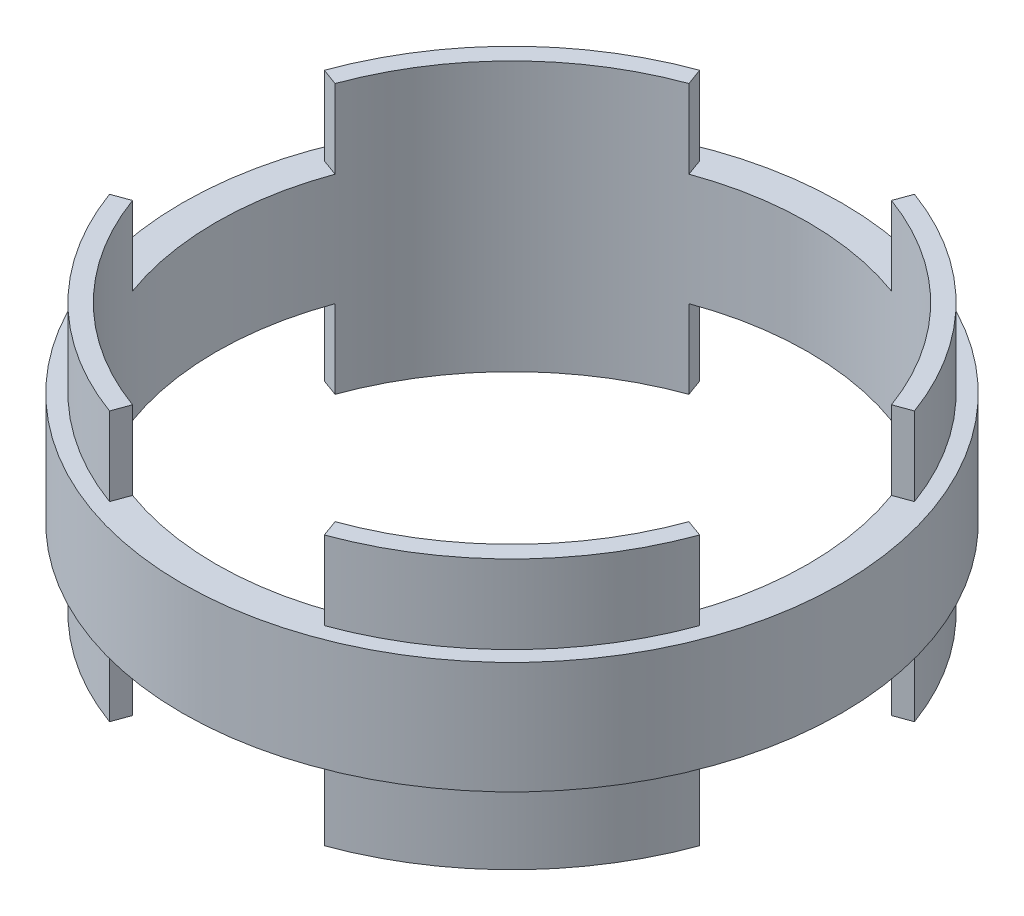
ISO-10303-21;
HEADER;
FILE_DESCRIPTION(('STEP AP214'),'2;1');
FILE_NAME('part.step','',(''),(''),'','','');
FILE_SCHEMA(('AUTOMOTIVE_DESIGN { 1 0 10303 214 1 1 1 1 }'));
ENDSEC;
DATA;
#1=APPLICATION_CONTEXT('core data for automotive mechanical design processes');
#2=APPLICATION_PROTOCOL_DEFINITION('international standard','automotive_design',2000,#1);
#3=PRODUCT_CONTEXT('',#1,'mechanical');
#4=PRODUCT('Part','Part','',(#3));
#5=PRODUCT_RELATED_PRODUCT_CATEGORY('part','',(#4));
#6=PRODUCT_DEFINITION_FORMATION('','',#4);
#7=PRODUCT_DEFINITION_CONTEXT('part definition',#1,'design');
#8=PRODUCT_DEFINITION('design','',#6,#7);
#9=PRODUCT_DEFINITION_SHAPE('','',#8);
#10=(LENGTH_UNIT() NAMED_UNIT(*) SI_UNIT(.MILLI.,.METRE.));
#11=(NAMED_UNIT(*) PLANE_ANGLE_UNIT() SI_UNIT($,.RADIAN.));
#12=(NAMED_UNIT(*) SI_UNIT($,.STERADIAN.) SOLID_ANGLE_UNIT());
#13=UNCERTAINTY_MEASURE_WITH_UNIT(LENGTH_MEASURE(1.E-05),#10,'distance_accuracy_value','');
#14=(GEOMETRIC_REPRESENTATION_CONTEXT(3) GLOBAL_UNCERTAINTY_ASSIGNED_CONTEXT((#13)) GLOBAL_UNIT_ASSIGNED_CONTEXT((#10,
#11,#12)) REPRESENTATION_CONTEXT('',''));
#15=CARTESIAN_POINT('',(0.,0.,0.));
#16=DIRECTION('',(0.,0.,1.));
#17=DIRECTION('',(1.,0.,0.));
#18=AXIS2_PLACEMENT_3D('',#15,#16,#17);
#19=CARTESIAN_POINT('',(0.,-38.1,0.));
#20=DIRECTION('',(0.939692620785908,0.,0.342020143325669));
#21=DIRECTION('',(0.342020143325669,0.,-0.939692620785908));
#22=AXIS2_PLACEMENT_3D('',#19,#20,#21);
#23=PLANE('',#22);
#24=DIRECTION('',(-0.342020143325669,0.,0.939692620785908));
#25=VECTOR('',#24,1.);
#26=CARTESIAN_POINT('',(0.,-15.875,0.));
#27=LINE('',#26,#25);
#28=CARTESIAN_POINT('',(30.405590741652,-15.875,-83.5386739878672));
#29=VERTEX_POINT('',#28);
#30=CARTESIAN_POINT('',(28.6681284135576,-15.875,-78.7650354742748));
#31=VERTEX_POINT('',#30);
#32=EDGE_CURVE('E294',#29,#31,#27,.T.);
#33=ORIENTED_EDGE('',*,*,#32,.F.);
#34=DIRECTION('',(0.,1.,0.));
#35=VECTOR('',#34,1.);
#36=CARTESIAN_POINT('',(30.405590741652,-38.1,-83.5386739878672));
#37=LINE('',#36,#35);
#38=CARTESIAN_POINT('',(30.405590741652,-38.1,-83.5386739878672));
#39=VERTEX_POINT('',#38);
#40=EDGE_CURVE('E396',#39,#29,#37,.T.);
#41=ORIENTED_EDGE('',*,*,#40,.F.);
#42=DIRECTION('',(0.342020143325669,0.,-0.939692620785908));
#43=VECTOR('',#42,1.);
#44=CARTESIAN_POINT('',(0.,-38.1,0.));
#45=LINE('',#44,#43);
#46=CARTESIAN_POINT('',(28.6681284135576,-38.1,-78.7650354742748));
#47=VERTEX_POINT('',#46);
#48=EDGE_CURVE('E390',#47,#39,#45,.T.);
#49=ORIENTED_EDGE('',*,*,#48,.F.);
#50=DIRECTION('',(0.,-1.,0.));
#51=VECTOR('',#50,1.);
#52=CARTESIAN_POINT('',(28.6681284135576,15.875,-78.7650354742748));
#53=LINE('',#52,#51);
#54=EDGE_CURVE('E59',#47,#31,#53,.F.);
#55=ORIENTED_EDGE('',*,*,#54,.T.);
#56=EDGE_LOOP('',(#33,#41,#49,#55));
#57=FACE_BOUND('',#56,.T.);
#58=ADVANCED_FACE('F36',(#57),#23,.F.);
#59=CARTESIAN_POINT('',(0.,-38.1,0.));
#60=DIRECTION('',(-0.939692620785908,0.,0.342020143325669));
#61=DIRECTION('',(0.342020143325669,0.,0.939692620785908));
#62=AXIS2_PLACEMENT_3D('',#59,#60,#61);
#63=PLANE('',#62);
#64=DIRECTION('',(-0.342020143325669,0.,-0.939692620785908));
#65=VECTOR('',#64,1.);
#66=CARTESIAN_POINT('',(0.,-15.875,0.));
#67=LINE('',#66,#65);
#68=CARTESIAN_POINT('',(-28.6681284135576,-15.875,-78.7650354742748));
#69=VERTEX_POINT('',#68);
#70=CARTESIAN_POINT('',(-30.405590741652,-15.875,-83.5386739878672));
#71=VERTEX_POINT('',#70);
#72=EDGE_CURVE('E293',#69,#71,#67,.T.);
#73=ORIENTED_EDGE('',*,*,#72,.F.);
#74=DIRECTION('',(0.,-1.,0.));
#75=VECTOR('',#74,1.);
#76=CARTESIAN_POINT('',(-28.6681284135576,15.875,-78.7650354742748));
#77=LINE('',#76,#75);
#78=CARTESIAN_POINT('',(-28.6681284135576,-38.1,-78.7650354742748));
#79=VERTEX_POINT('',#78);
#80=EDGE_CURVE('E297',#69,#79,#77,.T.);
#81=ORIENTED_EDGE('',*,*,#80,.T.);
#82=DIRECTION('',(0.342020143325669,0.,0.939692620785908));
#83=VECTOR('',#82,1.);
#84=CARTESIAN_POINT('',(0.,-38.1,0.));
#85=LINE('',#84,#83);
#86=CARTESIAN_POINT('',(-30.405590741652,-38.1,-83.5386739878672));
#87=VERTEX_POINT('',#86);
#88=EDGE_CURVE('E393',#87,#79,#85,.T.);
#89=ORIENTED_EDGE('',*,*,#88,.F.);
#90=DIRECTION('',(0.,1.,0.));
#91=VECTOR('',#90,1.);
#92=CARTESIAN_POINT('',(-30.405590741652,-38.1,-83.5386739878672));
#93=LINE('',#92,#91);
#94=EDGE_CURVE('E304',#87,#71,#93,.T.);
#95=ORIENTED_EDGE('',*,*,#94,.T.);
#96=EDGE_LOOP('',(#73,#81,#89,#95));
#97=FACE_BOUND('',#96,.T.);
#98=ADVANCED_FACE('F307',(#97),#63,.F.);
#99=CARTESIAN_POINT('',(0.,-38.1,0.));
#100=DIRECTION('',(0.342020143325666,0.,-0.939692620785909));
#101=DIRECTION('',(-0.93969262078591,0.,-0.342020143325666));
#102=AXIS2_PLACEMENT_3D('',#99,#100,#101);
#103=PLANE('',#102);
#104=DIRECTION('',(0.93969262078591,0.,0.342020143325666));
#105=VECTOR('',#104,1.);
#106=CARTESIAN_POINT('',(0.,-15.875,0.));
#107=LINE('',#106,#105);
#108=CARTESIAN_POINT('',(-83.5386739878673,-15.875,-30.4055907416517));
#109=VERTEX_POINT('',#108);
#110=CARTESIAN_POINT('',(-78.7650354742749,-15.875,-28.6681284135573));
#111=VERTEX_POINT('',#110);
#112=EDGE_CURVE('E309',#109,#111,#107,.T.);
#113=ORIENTED_EDGE('',*,*,#112,.F.);
#114=DIRECTION('',(0.,1.,0.));
#115=VECTOR('',#114,1.);
#116=CARTESIAN_POINT('',(-83.5386739878673,-38.1,-30.4055907416517));
#117=LINE('',#116,#115);
#118=CARTESIAN_POINT('',(-83.5386739878673,-38.1,-30.4055907416517));
#119=VERTEX_POINT('',#118);
#120=EDGE_CURVE('E375',#119,#109,#117,.T.);
#121=ORIENTED_EDGE('',*,*,#120,.F.);
#122=DIRECTION('',(-0.939692620785909,0.,-0.342020143325666));
#123=VECTOR('',#122,1.);
#124=CARTESIAN_POINT('',(0.,-38.1,0.));
#125=LINE('',#124,#123);
#126=CARTESIAN_POINT('',(-78.7650354742749,-38.1,-28.6681284135573));
#127=VERTEX_POINT('',#126);
#128=EDGE_CURVE('E368',#127,#119,#125,.T.);
#129=ORIENTED_EDGE('',*,*,#128,.F.);
#130=DIRECTION('',(0.,-1.,0.));
#131=VECTOR('',#130,1.);
#132=CARTESIAN_POINT('',(-78.7650354742749,15.875,-28.6681284135573));
#133=LINE('',#132,#131);
#134=EDGE_CURVE('E387',#127,#111,#133,.F.);
#135=ORIENTED_EDGE('',*,*,#134,.T.);
#136=EDGE_LOOP('',(#113,#121,#129,#135));
#137=FACE_BOUND('',#136,.T.);
#138=ADVANCED_FACE('F571',(#137),#103,.F.);
#139=CARTESIAN_POINT('',(0.,-38.1,0.));
#140=DIRECTION('',(0.342020143325673,0.,0.939692620785907));
#141=DIRECTION('',(0.939692620785907,0.,-0.342020143325673));
#142=AXIS2_PLACEMENT_3D('',#139,#140,#141);
#143=PLANE('',#142);
#144=DIRECTION('',(-0.939692620785907,0.,0.342020143325673));
#145=VECTOR('',#144,1.);
#146=CARTESIAN_POINT('',(0.,-15.875,0.));
#147=LINE('',#146,#145);
#148=CARTESIAN_POINT('',(-78.7650354742747,-15.875,28.6681284135579));
#149=VERTEX_POINT('',#148);
#150=CARTESIAN_POINT('',(-83.5386739878671,-15.875,30.4055907416523));
#151=VERTEX_POINT('',#150);
#152=EDGE_CURVE('E314',#149,#151,#147,.T.);
#153=ORIENTED_EDGE('',*,*,#152,.F.);
#154=DIRECTION('',(0.,-1.,0.));
#155=VECTOR('',#154,1.);
#156=CARTESIAN_POINT('',(-78.7650354742747,15.875,28.6681284135579));
#157=LINE('',#156,#155);
#158=CARTESIAN_POINT('',(-78.7650354742747,-38.1,28.6681284135579));
#159=VERTEX_POINT('',#158);
#160=EDGE_CURVE('E381',#149,#159,#157,.T.);
#161=ORIENTED_EDGE('',*,*,#160,.T.);
#162=DIRECTION('',(0.939692620785907,0.,-0.342020143325673));
#163=VECTOR('',#162,1.);
#164=CARTESIAN_POINT('',(0.,-38.1,0.));
#165=LINE('',#164,#163);
#166=CARTESIAN_POINT('',(-83.5386739878671,-38.1,30.4055907416523));
#167=VERTEX_POINT('',#166);
#168=EDGE_CURVE('E371',#167,#159,#165,.T.);
#169=ORIENTED_EDGE('',*,*,#168,.F.);
#170=DIRECTION('',(0.,1.,0.));
#171=VECTOR('',#170,1.);
#172=CARTESIAN_POINT('',(-83.5386739878671,-38.1,30.4055907416523));
#173=LINE('',#172,#171);
#174=EDGE_CURVE('E378',#167,#151,#173,.T.);
#175=ORIENTED_EDGE('',*,*,#174,.T.);
#176=EDGE_LOOP('',(#153,#161,#169,#175));
#177=FACE_BOUND('',#176,.T.);
#178=ADVANCED_FACE('F481',(#177),#143,.F.);
#179=CARTESIAN_POINT('',(0.,-38.1,0.));
#180=DIRECTION('',(-0.939692620785908,0.,-0.342020143325669));
#181=DIRECTION('',(-0.342020143325669,0.,0.939692620785908));
#182=AXIS2_PLACEMENT_3D('',#179,#180,#181);
#183=PLANE('',#182);
#184=DIRECTION('',(0.342020143325669,0.,-0.939692620785908));
#185=VECTOR('',#184,1.);
#186=CARTESIAN_POINT('',(0.,-15.875,0.));
#187=LINE('',#186,#185);
#188=CARTESIAN_POINT('',(-30.405590741652,-15.875,83.5386739878672));
#189=VERTEX_POINT('',#188);
#190=CARTESIAN_POINT('',(-28.6681284135576,-15.875,78.7650354742748));
#191=VERTEX_POINT('',#190);
#192=EDGE_CURVE('E266',#189,#191,#187,.T.);
#193=ORIENTED_EDGE('',*,*,#192,.F.);
#194=DIRECTION('',(0.,1.,0.));
#195=VECTOR('',#194,1.);
#196=CARTESIAN_POINT('',(-30.405590741652,-38.1,83.5386739878672));
#197=LINE('',#196,#195);
#198=CARTESIAN_POINT('',(-30.405590741652,-38.1,83.5386739878672));
#199=VERTEX_POINT('',#198);
#200=EDGE_CURVE('E358',#199,#189,#197,.T.);
#201=ORIENTED_EDGE('',*,*,#200,.F.);
#202=DIRECTION('',(-0.342020143325669,0.,0.939692620785908));
#203=VECTOR('',#202,1.);
#204=CARTESIAN_POINT('',(0.,-38.1,0.));
#205=LINE('',#204,#203);
#206=CARTESIAN_POINT('',(-28.6681284135576,-38.1,78.7650354742748));
#207=VERTEX_POINT('',#206);
#208=EDGE_CURVE('E352',#207,#199,#205,.T.);
#209=ORIENTED_EDGE('',*,*,#208,.F.);
#210=DIRECTION('',(0.,-1.,0.));
#211=VECTOR('',#210,1.);
#212=CARTESIAN_POINT('',(-28.6681284135576,15.875,78.7650354742748));
#213=LINE('',#212,#211);
#214=EDGE_CURVE('E365',#207,#191,#213,.F.);
#215=ORIENTED_EDGE('',*,*,#214,.T.);
#216=EDGE_LOOP('',(#193,#201,#209,#215));
#217=FACE_BOUND('',#216,.T.);
#218=ADVANCED_FACE('F627',(#217),#183,.F.);
#219=CARTESIAN_POINT('',(0.,-38.1,0.));
#220=DIRECTION('',(0.939692620785908,0.,-0.342020143325669));
#221=DIRECTION('',(-0.342020143325669,0.,-0.939692620785908));
#222=AXIS2_PLACEMENT_3D('',#219,#220,#221);
#223=PLANE('',#222);
#224=DIRECTION('',(0.342020143325669,0.,0.939692620785908));
#225=VECTOR('',#224,1.);
#226=CARTESIAN_POINT('',(0.,-15.875,0.));
#227=LINE('',#226,#225);
#228=CARTESIAN_POINT('',(28.6681284135576,-15.875,78.7650354742748));
#229=VERTEX_POINT('',#228);
#230=CARTESIAN_POINT('',(30.405590741652,-15.875,83.5386739878672));
#231=VERTEX_POINT('',#230);
#232=EDGE_CURVE('E261',#229,#231,#227,.T.);
#233=ORIENTED_EDGE('',*,*,#232,.F.);
#234=DIRECTION('',(0.,-1.,0.));
#235=VECTOR('',#234,1.);
#236=CARTESIAN_POINT('',(28.6681284135576,15.875,78.7650354742748));
#237=LINE('',#236,#235);
#238=CARTESIAN_POINT('',(28.6681284135576,-38.1,78.7650354742748));
#239=VERTEX_POINT('',#238);
#240=EDGE_CURVE('E245',#229,#239,#237,.T.);
#241=ORIENTED_EDGE('',*,*,#240,.T.);
#242=DIRECTION('',(-0.342020143325669,0.,-0.939692620785908));
#243=VECTOR('',#242,1.);
#244=CARTESIAN_POINT('',(0.,-38.1,0.));
#245=LINE('',#244,#243);
#246=CARTESIAN_POINT('',(30.405590741652,-38.1,83.5386739878672));
#247=VERTEX_POINT('',#246);
#248=EDGE_CURVE('E355',#247,#239,#245,.T.);
#249=ORIENTED_EDGE('',*,*,#248,.F.);
#250=DIRECTION('',(0.,1.,0.));
#251=VECTOR('',#250,1.);
#252=CARTESIAN_POINT('',(30.405590741652,-38.1,83.5386739878672));
#253=LINE('',#252,#251);
#254=EDGE_CURVE('E257',#247,#231,#253,.T.);
#255=ORIENTED_EDGE('',*,*,#254,.T.);
#256=EDGE_LOOP('',(#233,#241,#249,#255));
#257=FACE_BOUND('',#256,.T.);
#258=ADVANCED_FACE('F262',(#257),#223,.F.);
#259=CARTESIAN_POINT('',(0.,-38.1,0.));
#260=DIRECTION('',(-0.34202014332566,0.,0.939692620785912));
#261=DIRECTION('',(0.939692620785912,0.,0.34202014332566));
#262=AXIS2_PLACEMENT_3D('',#259,#260,#261);
#263=PLANE('',#262);
#264=DIRECTION('',(-0.939692620785912,0.,-0.34202014332566));
#265=VECTOR('',#264,1.);
#266=CARTESIAN_POINT('',(0.,-15.875,0.));
#267=LINE('',#266,#265);
#268=CARTESIAN_POINT('',(83.5386739878675,-15.875,30.4055907416512));
#269=VERTEX_POINT('',#268);
#270=CARTESIAN_POINT('',(78.7650354742751,-15.875,28.6681284135568));
#271=VERTEX_POINT('',#270);
#272=EDGE_CURVE('E267',#269,#271,#267,.T.);
#273=ORIENTED_EDGE('',*,*,#272,.F.);
#274=DIRECTION('',(0.,1.,0.));
#275=VECTOR('',#274,1.);
#276=CARTESIAN_POINT('',(83.5386739878675,-38.1,30.4055907416512));
#277=LINE('',#276,#275);
#278=CARTESIAN_POINT('',(83.5386739878675,-38.1,30.4055907416512));
#279=VERTEX_POINT('',#278);
#280=EDGE_CURVE('E338',#279,#269,#277,.T.);
#281=ORIENTED_EDGE('',*,*,#280,.F.);
#282=DIRECTION('',(0.939692620785912,0.,0.34202014332566));
#283=VECTOR('',#282,1.);
#284=CARTESIAN_POINT('',(0.,-38.1,0.));
#285=LINE('',#284,#283);
#286=CARTESIAN_POINT('',(78.7650354742751,-38.1,28.6681284135568));
#287=VERTEX_POINT('',#286);
#288=EDGE_CURVE('E331',#287,#279,#285,.T.);
#289=ORIENTED_EDGE('',*,*,#288,.F.);
#290=DIRECTION('',(0.,-1.,0.));
#291=VECTOR('',#290,1.);
#292=CARTESIAN_POINT('',(78.7650354742751,15.875,28.6681284135568));
#293=LINE('',#292,#291);
#294=EDGE_CURVE('E349',#287,#271,#293,.F.);
#295=ORIENTED_EDGE('',*,*,#294,.T.);
#296=EDGE_LOOP('',(#273,#281,#289,#295));
#297=FACE_BOUND('',#296,.T.);
#298=ADVANCED_FACE('F593',(#297),#263,.F.);
#299=CARTESIAN_POINT('',(0.,-38.1,0.));
#300=DIRECTION('',(-0.342020143325679,0.,-0.939692620785905));
#301=DIRECTION('',(-0.939692620785905,0.,0.342020143325679));
#302=AXIS2_PLACEMENT_3D('',#299,#300,#301);
#303=PLANE('',#302);
#304=DIRECTION('',(0.939692620785905,0.,-0.342020143325679));
#305=VECTOR('',#304,1.);
#306=CARTESIAN_POINT('',(0.,-15.875,0.));
#307=LINE('',#306,#305);
#308=CARTESIAN_POINT('',(78.7650354742745,-15.875,-28.6681284135584));
#309=VERTEX_POINT('',#308);
#310=CARTESIAN_POINT('',(83.5386739878669,-15.875,-30.4055907416529));
#311=VERTEX_POINT('',#310);
#312=EDGE_CURVE('E44',#309,#311,#307,.T.);
#313=ORIENTED_EDGE('',*,*,#312,.F.);
#314=DIRECTION('',(0.,-1.,0.));
#315=VECTOR('',#314,1.);
#316=CARTESIAN_POINT('',(78.7650354742745,15.875,-28.6681284135584));
#317=LINE('',#316,#315);
#318=CARTESIAN_POINT('',(78.7650354742745,-38.1,-28.6681284135584));
#319=VERTEX_POINT('',#318);
#320=EDGE_CURVE('E343',#309,#319,#317,.T.);
#321=ORIENTED_EDGE('',*,*,#320,.T.);
#322=DIRECTION('',(-0.939692620785905,0.,0.342020143325679));
#323=VECTOR('',#322,1.);
#324=CARTESIAN_POINT('',(0.,-38.1,0.));
#325=LINE('',#324,#323);
#326=CARTESIAN_POINT('',(83.5386739878669,-38.1,-30.4055907416529));
#327=VERTEX_POINT('',#326);
#328=EDGE_CURVE('E334',#327,#319,#325,.T.);
#329=ORIENTED_EDGE('',*,*,#328,.F.);
#330=DIRECTION('',(0.,1.,0.));
#331=VECTOR('',#330,1.);
#332=CARTESIAN_POINT('',(83.5386739878669,-38.1,-30.4055907416529));
#333=LINE('',#332,#331);
#334=EDGE_CURVE('E341',#327,#311,#333,.T.);
#335=ORIENTED_EDGE('',*,*,#334,.T.);
#336=EDGE_LOOP('',(#313,#321,#329,#335));
#337=FACE_BOUND('',#336,.T.);
#338=ADVANCED_FACE('F466',(#337),#303,.F.);
#339=CARTESIAN_POINT('',(0.,38.1,0.));
#340=DIRECTION('',(0.,-1.,0.));
#341=DIRECTION('',(0.,0.,-1.));
#342=AXIS2_PLACEMENT_3D('',#339,#340,#341);
#343=CYLINDRICAL_SURFACE('',#342,88.9);
#344=CARTESIAN_POINT('',(0.,-38.1,0.));
#345=DIRECTION('',(0.,1.,0.));
#346=DIRECTION('',(0.,0.,1.));
#347=AXIS2_PLACEMENT_3D('',#344,#345,#346);
#348=CIRCLE('',#347,88.9);
#349=EDGE_CURVE('E643',#247,#279,#348,.T.);
#350=ORIENTED_EDGE('',*,*,#349,.T.);
#351=ORIENTED_EDGE('',*,*,#280,.T.);
#352=CARTESIAN_POINT('',(0.,-15.875,0.));
#353=DIRECTION('',(0.,1.,0.));
#354=DIRECTION('',(0.,0.,1.));
#355=AXIS2_PLACEMENT_3D('',#352,#353,#354);
#356=CIRCLE('',#355,88.9);
#357=EDGE_CURVE('E436',#269,#231,#356,.F.);
#358=ORIENTED_EDGE('',*,*,#357,.T.);
#359=ORIENTED_EDGE('',*,*,#254,.F.);
#360=EDGE_LOOP('',(#350,#351,#358,#359));
#361=FACE_BOUND('',#360,.T.);
#362=ADVANCED_FACE('F578',(#361),#343,.T.);
#363=CARTESIAN_POINT('',(0.,-38.1,0.));
#364=DIRECTION('',(0.,1.,0.));
#365=DIRECTION('',(0.,0.,1.));
#366=AXIS2_PLACEMENT_3D('',#363,#364,#365);
#367=PLANE('',#366);
#368=CARTESIAN_POINT('',(0.,-38.1,0.));
#369=DIRECTION('',(0.,1.,0.));
#370=DIRECTION('',(0.,0.,1.));
#371=AXIS2_PLACEMENT_3D('',#368,#369,#370);
#372=CIRCLE('',#371,83.82);
#373=EDGE_CURVE('E253',#239,#287,#372,.T.);
#374=ORIENTED_EDGE('',*,*,#373,.T.);
#375=ORIENTED_EDGE('',*,*,#288,.T.);
#376=ORIENTED_EDGE('',*,*,#349,.F.);
#377=ORIENTED_EDGE('',*,*,#248,.T.);
#378=EDGE_LOOP('',(#374,#375,#376,#377));
#379=FACE_BOUND('',#378,.T.);
#380=ADVANCED_FACE('F584',(#379),#367,.F.);
#381=CARTESIAN_POINT('',(0.,38.1,0.));
#382=DIRECTION('',(0.,1.,0.));
#383=DIRECTION('',(0.,0.,1.));
#384=AXIS2_PLACEMENT_3D('',#381,#382,#383);
#385=PLANE('',#384);
#386=DIRECTION('',(0.939692620785912,0.,0.34202014332566));
#387=VECTOR('',#386,1.);
#388=CARTESIAN_POINT('',(0.,38.1,0.));
#389=LINE('',#388,#387);
#390=CARTESIAN_POINT('',(78.7650354742751,38.1,28.6681284135568));
#391=VERTEX_POINT('',#390);
#392=CARTESIAN_POINT('',(83.5386739878675,38.1,30.4055907416512));
#393=VERTEX_POINT('',#392);
#394=EDGE_CURVE('E330',#391,#393,#389,.T.);
#395=ORIENTED_EDGE('',*,*,#394,.F.);
#396=CARTESIAN_POINT('',(0.,38.1,0.));
#397=DIRECTION('',(0.,1.,0.));
#398=DIRECTION('',(0.,0.,1.));
#399=AXIS2_PLACEMENT_3D('',#396,#397,#398);
#400=CIRCLE('',#399,83.82);
#401=CARTESIAN_POINT('',(28.6681284135576,38.1,78.7650354742748));
#402=VERTEX_POINT('',#401);
#403=EDGE_CURVE('E611',#402,#391,#400,.T.);
#404=ORIENTED_EDGE('',*,*,#403,.F.);
#405=DIRECTION('',(-0.342020143325669,0.,-0.939692620785908));
#406=VECTOR('',#405,1.);
#407=CARTESIAN_POINT('',(0.,38.1,0.));
#408=LINE('',#407,#406);
#409=CARTESIAN_POINT('',(30.405590741652,38.1,83.5386739878672));
#410=VERTEX_POINT('',#409);
#411=EDGE_CURVE('E356',#410,#402,#408,.T.);
#412=ORIENTED_EDGE('',*,*,#411,.F.);
#413=CARTESIAN_POINT('',(0.,38.1,0.));
#414=DIRECTION('',(0.,1.,0.));
#415=DIRECTION('',(0.,0.,1.));
#416=AXIS2_PLACEMENT_3D('',#413,#414,#415);
#417=CIRCLE('',#416,88.9);
#418=EDGE_CURVE('E517',#410,#393,#417,.T.);
#419=ORIENTED_EDGE('',*,*,#418,.T.);
#420=EDGE_LOOP('',(#395,#404,#412,#419));
#421=FACE_BOUND('',#420,.T.);
#422=ADVANCED_FACE('F582',(#421),#385,.T.);
#423=CARTESIAN_POINT('',(0.,15.875,0.));
#424=DIRECTION('',(0.,1.,0.));
#425=DIRECTION('',(0.,0.,1.));
#426=AXIS2_PLACEMENT_3D('',#423,#424,#425);
#427=CIRCLE('',#426,88.9);
#428=CARTESIAN_POINT('',(83.5386739878675,15.875,30.4055907416512));
#429=VERTEX_POINT('',#428);
#430=CARTESIAN_POINT('',(30.405590741652,15.875,83.5386739878672));
#431=VERTEX_POINT('',#430);
#432=EDGE_CURVE('E424',#429,#431,#427,.F.);
#433=ORIENTED_EDGE('',*,*,#432,.F.);
#434=DIRECTION('',(0.,-1.,0.));
#435=VECTOR('',#434,1.);
#436=CARTESIAN_POINT('',(83.5386739878675,38.1,30.4055907416511));
#437=LINE('',#436,#435);
#438=EDGE_CURVE('E461',#429,#393,#437,.F.);
#439=ORIENTED_EDGE('',*,*,#438,.T.);
#440=ORIENTED_EDGE('',*,*,#418,.F.);
#441=DIRECTION('',(0.,-1.,0.));
#442=VECTOR('',#441,1.);
#443=CARTESIAN_POINT('',(30.405590741652,38.1,83.5386739878672));
#444=LINE('',#443,#442);
#445=EDGE_CURVE('E452',#410,#431,#444,.T.);
#446=ORIENTED_EDGE('',*,*,#445,.T.);
#447=EDGE_LOOP('',(#433,#439,#440,#446));
#448=FACE_BOUND('',#447,.T.);
#449=ADVANCED_FACE('F586',(#448),#343,.T.);
#450=EDGE_CURVE('E423',#167,#199,#348,.T.);
#451=ORIENTED_EDGE('',*,*,#450,.T.);
#452=ORIENTED_EDGE('',*,*,#200,.T.);
#453=EDGE_CURVE('E439',#189,#151,#356,.F.);
#454=ORIENTED_EDGE('',*,*,#453,.T.);
#455=ORIENTED_EDGE('',*,*,#174,.F.);
#456=EDGE_LOOP('',(#451,#452,#454,#455));
#457=FACE_BOUND('',#456,.T.);
#458=ADVANCED_FACE('F476',(#457),#343,.T.);
#459=EDGE_CURVE('E413',#159,#207,#372,.T.);
#460=ORIENTED_EDGE('',*,*,#459,.T.);
#461=ORIENTED_EDGE('',*,*,#208,.T.);
#462=ORIENTED_EDGE('',*,*,#450,.F.);
#463=ORIENTED_EDGE('',*,*,#168,.T.);
#464=EDGE_LOOP('',(#460,#461,#462,#463));
#465=FACE_BOUND('',#464,.T.);
#466=ADVANCED_FACE('F592',(#465),#367,.F.);
#467=DIRECTION('',(-0.342020143325669,0.,0.939692620785908));
#468=VECTOR('',#467,1.);
#469=CARTESIAN_POINT('',(0.,38.1,0.));
#470=LINE('',#469,#468);
#471=CARTESIAN_POINT('',(-28.6681284135576,38.1,78.7650354742748));
#472=VERTEX_POINT('',#471);
#473=CARTESIAN_POINT('',(-30.405590741652,38.1,83.5386739878672));
#474=VERTEX_POINT('',#473);
#475=EDGE_CURVE('E351',#472,#474,#470,.T.);
#476=ORIENTED_EDGE('',*,*,#475,.F.);
#477=CARTESIAN_POINT('',(-78.7650354742747,38.1,28.6681284135579));
#478=VERTEX_POINT('',#477);
#479=EDGE_CURVE('E410',#478,#472,#400,.T.);
#480=ORIENTED_EDGE('',*,*,#479,.F.);
#481=DIRECTION('',(0.939692620785907,0.,-0.342020143325673));
#482=VECTOR('',#481,1.);
#483=CARTESIAN_POINT('',(0.,38.1,0.));
#484=LINE('',#483,#482);
#485=CARTESIAN_POINT('',(-83.5386739878671,38.1,30.4055907416523));
#486=VERTEX_POINT('',#485);
#487=EDGE_CURVE('E372',#486,#478,#484,.T.);
#488=ORIENTED_EDGE('',*,*,#487,.F.);
#489=EDGE_CURVE('E418',#486,#474,#417,.T.);
#490=ORIENTED_EDGE('',*,*,#489,.T.);
#491=EDGE_LOOP('',(#476,#480,#488,#490));
#492=FACE_BOUND('',#491,.T.);
#493=ADVANCED_FACE('F514',(#492),#385,.T.);
#494=CARTESIAN_POINT('',(-30.405590741652,15.875,83.5386739878672));
#495=VERTEX_POINT('',#494);
#496=CARTESIAN_POINT('',(-83.5386739878671,15.875,30.4055907416523));
#497=VERTEX_POINT('',#496);
#498=EDGE_CURVE('E428',#495,#497,#427,.F.);
#499=ORIENTED_EDGE('',*,*,#498,.F.);
#500=DIRECTION('',(0.,-1.,0.));
#501=VECTOR('',#500,1.);
#502=CARTESIAN_POINT('',(-30.405590741652,38.1,83.5386739878672));
#503=LINE('',#502,#501);
#504=EDGE_CURVE('E455',#495,#474,#503,.F.);
#505=ORIENTED_EDGE('',*,*,#504,.T.);
#506=ORIENTED_EDGE('',*,*,#489,.F.);
#507=DIRECTION('',(0.,-1.,0.));
#508=VECTOR('',#507,1.);
#509=CARTESIAN_POINT('',(-83.5386739878671,38.1,30.4055907416523));
#510=LINE('',#509,#508);
#511=EDGE_CURVE('E446',#486,#497,#510,.T.);
#512=ORIENTED_EDGE('',*,*,#511,.T.);
#513=EDGE_LOOP('',(#499,#505,#506,#512));
#514=FACE_BOUND('',#513,.T.);
#515=ADVANCED_FACE('F516',(#514),#343,.T.);
#516=EDGE_CURVE('E420',#87,#119,#348,.T.);
#517=ORIENTED_EDGE('',*,*,#516,.T.);
#518=ORIENTED_EDGE('',*,*,#120,.T.);
#519=EDGE_CURVE('E432',#109,#71,#356,.F.);
#520=ORIENTED_EDGE('',*,*,#519,.T.);
#521=ORIENTED_EDGE('',*,*,#94,.F.);
#522=EDGE_LOOP('',(#517,#518,#520,#521));
#523=FACE_BOUND('',#522,.T.);
#524=ADVANCED_FACE('F552',(#523),#343,.T.);
#525=EDGE_CURVE('E300',#79,#127,#372,.T.);
#526=ORIENTED_EDGE('',*,*,#525,.T.);
#527=ORIENTED_EDGE('',*,*,#128,.T.);
#528=ORIENTED_EDGE('',*,*,#516,.F.);
#529=ORIENTED_EDGE('',*,*,#88,.T.);
#530=EDGE_LOOP('',(#526,#527,#528,#529));
#531=FACE_BOUND('',#530,.T.);
#532=ADVANCED_FACE('F559',(#531),#367,.F.);
#533=DIRECTION('',(-0.939692620785909,0.,-0.342020143325666));
#534=VECTOR('',#533,1.);
#535=CARTESIAN_POINT('',(0.,38.1,0.));
#536=LINE('',#535,#534);
#537=CARTESIAN_POINT('',(-78.7650354742749,38.1,-28.6681284135573));
#538=VERTEX_POINT('',#537);
#539=CARTESIAN_POINT('',(-83.5386739878673,38.1,-30.4055907416517));
#540=VERTEX_POINT('',#539);
#541=EDGE_CURVE('E367',#538,#540,#536,.T.);
#542=ORIENTED_EDGE('',*,*,#541,.F.);
#543=CARTESIAN_POINT('',(-28.6681284135576,38.1,-78.7650354742748));
#544=VERTEX_POINT('',#543);
#545=EDGE_CURVE('E406',#544,#538,#400,.T.);
#546=ORIENTED_EDGE('',*,*,#545,.F.);
#547=DIRECTION('',(0.342020143325669,0.,0.939692620785908));
#548=VECTOR('',#547,1.);
#549=CARTESIAN_POINT('',(0.,38.1,0.));
#550=LINE('',#549,#548);
#551=CARTESIAN_POINT('',(-30.405590741652,38.1,-83.5386739878672));
#552=VERTEX_POINT('',#551);
#553=EDGE_CURVE('E394',#552,#544,#550,.T.);
#554=ORIENTED_EDGE('',*,*,#553,.F.);
#555=EDGE_CURVE('E414',#552,#540,#417,.T.);
#556=ORIENTED_EDGE('',*,*,#555,.T.);
#557=EDGE_LOOP('',(#542,#546,#554,#556));
#558=FACE_BOUND('',#557,.T.);
#559=ADVANCED_FACE('F544',(#558),#385,.T.);
#560=CARTESIAN_POINT('',(-83.5386739878673,15.875,-30.4055907416517));
#561=VERTEX_POINT('',#560);
#562=CARTESIAN_POINT('',(-30.405590741652,15.875,-83.5386739878672));
#563=VERTEX_POINT('',#562);
#564=EDGE_CURVE('E417',#561,#563,#427,.F.);
#565=ORIENTED_EDGE('',*,*,#564,.F.);
#566=DIRECTION('',(0.,-1.,0.));
#567=VECTOR('',#566,1.);
#568=CARTESIAN_POINT('',(-83.5386739878673,38.1,-30.4055907416517));
#569=LINE('',#568,#567);
#570=EDGE_CURVE('E449',#561,#540,#569,.F.);
#571=ORIENTED_EDGE('',*,*,#570,.T.);
#572=ORIENTED_EDGE('',*,*,#555,.F.);
#573=DIRECTION('',(0.,-1.,0.));
#574=VECTOR('',#573,1.);
#575=CARTESIAN_POINT('',(-30.405590741652,38.1,-83.5386739878672));
#576=LINE('',#575,#574);
#577=EDGE_CURVE('E440',#552,#563,#576,.T.);
#578=ORIENTED_EDGE('',*,*,#577,.T.);
#579=EDGE_LOOP('',(#565,#571,#572,#578));
#580=FACE_BOUND('',#579,.T.);
#581=ADVANCED_FACE('F549',(#580),#343,.T.);
#582=CARTESIAN_POINT('',(0.,15.875,0.));
#583=DIRECTION('',(0.,1.,0.));
#584=DIRECTION('',(0.,0.,1.));
#585=AXIS2_PLACEMENT_3D('',#582,#583,#584);
#586=PLANE('',#585);
#587=CARTESIAN_POINT('',(0.,15.875,0.));
#588=DIRECTION('',(0.,1.,0.));
#589=DIRECTION('',(0.,0.,1.));
#590=AXIS2_PLACEMENT_3D('',#587,#588,#589);
#591=CIRCLE('',#590,93.345);
#592=CARTESIAN_POINT('',(0.,15.875,93.345));
#593=VERTEX_POINT('',#592);
#594=EDGE_CURVE('E429',#593,#593,#591,.T.);
#595=ORIENTED_EDGE('',*,*,#594,.T.);
#596=EDGE_LOOP('',(#595));
#597=FACE_BOUND('',#596,.T.);
#598=ORIENTED_EDGE('',*,*,#564,.T.);
#599=DIRECTION('',(-0.342020143325669,0.,-0.939692620785908));
#600=VECTOR('',#599,1.);
#601=CARTESIAN_POINT('',(0.,15.875,0.));
#602=LINE('',#601,#600);
#603=CARTESIAN_POINT('',(-28.6681284135576,15.875,-78.7650354742748));
#604=VERTEX_POINT('',#603);
#605=EDGE_CURVE('E327',#604,#563,#602,.T.);
#606=ORIENTED_EDGE('',*,*,#605,.F.);
#607=CARTESIAN_POINT('',(0.,15.875,0.));
#608=DIRECTION('',(0.,1.,0.));
#609=DIRECTION('',(0.,0.,1.));
#610=AXIS2_PLACEMENT_3D('',#607,#608,#609);
#611=CIRCLE('',#610,83.82);
#612=CARTESIAN_POINT('',(28.6681284135576,15.875,-78.7650354742748));
#613=VERTEX_POINT('',#612);
#614=EDGE_CURVE('E485',#613,#604,#611,.T.);
#615=ORIENTED_EDGE('',*,*,#614,.F.);
#616=DIRECTION('',(-0.342020143325669,0.,0.939692620785908));
#617=VECTOR('',#616,1.);
#618=CARTESIAN_POINT('',(0.,15.875,0.));
#619=LINE('',#618,#617);
#620=CARTESIAN_POINT('',(30.405590741652,15.875,-83.5386739878672));
#621=VERTEX_POINT('',#620);
#622=EDGE_CURVE('E51',#621,#613,#619,.T.);
#623=ORIENTED_EDGE('',*,*,#622,.F.);
#624=CARTESIAN_POINT('',(83.5386739878669,15.875,-30.4055907416529));
#625=VERTEX_POINT('',#624);
#626=EDGE_CURVE('E427',#621,#625,#427,.F.);
#627=ORIENTED_EDGE('',*,*,#626,.T.);
#628=DIRECTION('',(0.939692620785905,0.,-0.342020143325679));
#629=VECTOR('',#628,1.);
#630=CARTESIAN_POINT('',(0.,15.875,0.));
#631=LINE('',#630,#629);
#632=CARTESIAN_POINT('',(78.7650354742745,15.875,-28.6681284135584));
#633=VERTEX_POINT('',#632);
#634=EDGE_CURVE('E11',#633,#625,#631,.T.);
#635=ORIENTED_EDGE('',*,*,#634,.F.);
#636=CARTESIAN_POINT('',(78.7650354742751,15.875,28.6681284135568));
#637=VERTEX_POINT('',#636);
#638=EDGE_CURVE('E287',#637,#633,#611,.T.);
#639=ORIENTED_EDGE('',*,*,#638,.F.);
#640=DIRECTION('',(-0.939692620785912,0.,-0.34202014332566));
#641=VECTOR('',#640,1.);
#642=CARTESIAN_POINT('',(0.,15.875,0.));
#643=LINE('',#642,#641);
#644=EDGE_CURVE('E311',#429,#637,#643,.T.);
#645=ORIENTED_EDGE('',*,*,#644,.F.);
#646=ORIENTED_EDGE('',*,*,#432,.T.);
#647=DIRECTION('',(0.342020143325669,0.,0.939692620785908));
#648=VECTOR('',#647,1.);
#649=CARTESIAN_POINT('',(0.,15.875,0.));
#650=LINE('',#649,#648);
#651=CARTESIAN_POINT('',(28.6681284135576,15.875,78.7650354742748));
#652=VERTEX_POINT('',#651);
#653=EDGE_CURVE('E319',#652,#431,#650,.T.);
#654=ORIENTED_EDGE('',*,*,#653,.F.);
#655=CARTESIAN_POINT('',(-28.6681284135576,15.875,78.7650354742748));
#656=VERTEX_POINT('',#655);
#657=EDGE_CURVE('E281',#656,#652,#611,.T.);
#658=ORIENTED_EDGE('',*,*,#657,.F.);
#659=DIRECTION('',(0.342020143325669,0.,-0.939692620785908));
#660=VECTOR('',#659,1.);
#661=CARTESIAN_POINT('',(0.,15.875,0.));
#662=LINE('',#661,#660);
#663=EDGE_CURVE('E321',#495,#656,#662,.T.);
#664=ORIENTED_EDGE('',*,*,#663,.F.);
#665=ORIENTED_EDGE('',*,*,#498,.T.);
#666=DIRECTION('',(-0.939692620785907,0.,0.342020143325673));
#667=VECTOR('',#666,1.);
#668=CARTESIAN_POINT('',(0.,15.875,0.));
#669=LINE('',#668,#667);
#670=CARTESIAN_POINT('',(-78.7650354742747,15.875,28.6681284135579));
#671=VERTEX_POINT('',#670);
#672=EDGE_CURVE('E323',#671,#497,#669,.T.);
#673=ORIENTED_EDGE('',*,*,#672,.F.);
#674=CARTESIAN_POINT('',(-78.7650354742749,15.875,-28.6681284135573));
#675=VERTEX_POINT('',#674);
#676=EDGE_CURVE('E286',#675,#671,#611,.T.);
#677=ORIENTED_EDGE('',*,*,#676,.F.);
#678=DIRECTION('',(0.93969262078591,0.,0.342020143325666));
#679=VECTOR('',#678,1.);
#680=CARTESIAN_POINT('',(0.,15.875,0.));
#681=LINE('',#680,#679);
#682=EDGE_CURVE('E325',#561,#675,#681,.T.);
#683=ORIENTED_EDGE('',*,*,#682,.F.);
#684=EDGE_LOOP('',(#598,#606,#615,#623,#627,#635,#639,#645,#646,#654,#658,#664,#665,#673,#677,#683));
#685=FACE_BOUND('',#684,.T.);
#686=ADVANCED_FACE('F503',(#597,#685),#586,.T.);
#687=CARTESIAN_POINT('',(0.,-15.875,0.));
#688=DIRECTION('',(0.,1.,0.));
#689=DIRECTION('',(0.,0.,1.));
#690=AXIS2_PLACEMENT_3D('',#687,#688,#689);
#691=PLANE('',#690);
#692=CARTESIAN_POINT('',(0.,-15.875,0.));
#693=DIRECTION('',(0.,1.,0.));
#694=DIRECTION('',(0.,0.,1.));
#695=AXIS2_PLACEMENT_3D('',#692,#693,#694);
#696=CIRCLE('',#695,93.345);
#697=CARTESIAN_POINT('',(0.,-15.875,93.345));
#698=VERTEX_POINT('',#697);
#699=EDGE_CURVE('E433',#698,#698,#696,.T.);
#700=ORIENTED_EDGE('',*,*,#699,.F.);
#701=EDGE_LOOP('',(#700));
#702=FACE_BOUND('',#701,.T.);
#703=EDGE_CURVE('E438',#29,#311,#356,.F.);
#704=ORIENTED_EDGE('',*,*,#703,.F.);
#705=ORIENTED_EDGE('',*,*,#32,.T.);
#706=CARTESIAN_POINT('',(0.,-15.875,0.));
#707=DIRECTION('',(0.,1.,0.));
#708=DIRECTION('',(0.,0.,1.));
#709=AXIS2_PLACEMENT_3D('',#706,#707,#708);
#710=CIRCLE('',#709,83.82);
#711=EDGE_CURVE('E277',#31,#69,#710,.T.);
#712=ORIENTED_EDGE('',*,*,#711,.T.);
#713=ORIENTED_EDGE('',*,*,#72,.T.);
#714=ORIENTED_EDGE('',*,*,#519,.F.);
#715=ORIENTED_EDGE('',*,*,#112,.T.);
#716=EDGE_CURVE('E273',#111,#149,#710,.T.);
#717=ORIENTED_EDGE('',*,*,#716,.T.);
#718=ORIENTED_EDGE('',*,*,#152,.T.);
#719=ORIENTED_EDGE('',*,*,#453,.F.);
#720=ORIENTED_EDGE('',*,*,#192,.T.);
#721=EDGE_CURVE('E250',#191,#229,#710,.T.);
#722=ORIENTED_EDGE('',*,*,#721,.T.);
#723=ORIENTED_EDGE('',*,*,#232,.T.);
#724=ORIENTED_EDGE('',*,*,#357,.F.);
#725=ORIENTED_EDGE('',*,*,#272,.T.);
#726=EDGE_CURVE('E275',#271,#309,#710,.T.);
#727=ORIENTED_EDGE('',*,*,#726,.T.);
#728=ORIENTED_EDGE('',*,*,#312,.T.);
#729=EDGE_LOOP('',(#704,#705,#712,#713,#714,#715,#717,#718,#719,#720,#722,#723,#724,#725,#727,#728));
#730=FACE_BOUND('',#729,.T.);
#731=ADVANCED_FACE('F271',(#702,#730),#691,.F.);
#732=CARTESIAN_POINT('',(0.,15.875,0.));
#733=DIRECTION('',(0.,-1.,0.));
#734=DIRECTION('',(0.,0.,-1.));
#735=AXIS2_PLACEMENT_3D('',#732,#733,#734);
#736=CYLINDRICAL_SURFACE('',#735,93.345);
#737=ORIENTED_EDGE('',*,*,#594,.F.);
#738=EDGE_LOOP('',(#737));
#739=FACE_BOUND('',#738,.T.);
#740=ORIENTED_EDGE('',*,*,#699,.T.);
#741=EDGE_LOOP('',(#740));
#742=FACE_BOUND('',#741,.T.);
#743=ADVANCED_FACE('F38',(#739,#742),#736,.T.);
#744=ORIENTED_EDGE('',*,*,#703,.T.);
#745=ORIENTED_EDGE('',*,*,#334,.F.);
#746=EDGE_CURVE('E409',#327,#39,#348,.T.);
#747=ORIENTED_EDGE('',*,*,#746,.T.);
#748=ORIENTED_EDGE('',*,*,#40,.T.);
#749=EDGE_LOOP('',(#744,#745,#747,#748));
#750=FACE_BOUND('',#749,.T.);
#751=ADVANCED_FACE('F470',(#750),#343,.T.);
#752=ORIENTED_EDGE('',*,*,#746,.F.);
#753=ORIENTED_EDGE('',*,*,#328,.T.);
#754=EDGE_CURVE('E405',#319,#47,#372,.T.);
#755=ORIENTED_EDGE('',*,*,#754,.T.);
#756=ORIENTED_EDGE('',*,*,#48,.T.);
#757=EDGE_LOOP('',(#752,#753,#755,#756));
#758=FACE_BOUND('',#757,.T.);
#759=ADVANCED_FACE('F564',(#758),#367,.F.);
#760=CARTESIAN_POINT('',(0.,15.875,0.));
#761=DIRECTION('',(0.,-1.,0.));
#762=DIRECTION('',(0.,0.,-1.));
#763=AXIS2_PLACEMENT_3D('',#760,#761,#762);
#764=CYLINDRICAL_SURFACE('',#763,83.82);
#765=CARTESIAN_POINT('',(28.6681284135576,38.1,-78.7650354742748));
#766=VERTEX_POINT('',#765);
#767=EDGE_CURVE('E403',#613,#766,#53,.F.);
#768=ORIENTED_EDGE('',*,*,#767,.F.);
#769=ORIENTED_EDGE('',*,*,#614,.T.);
#770=EDGE_CURVE('E303',#544,#604,#77,.T.);
#771=ORIENTED_EDGE('',*,*,#770,.F.);
#772=ORIENTED_EDGE('',*,*,#545,.T.);
#773=EDGE_CURVE('E386',#675,#538,#133,.F.);
#774=ORIENTED_EDGE('',*,*,#773,.F.);
#775=ORIENTED_EDGE('',*,*,#676,.T.);
#776=EDGE_CURVE('E384',#478,#671,#157,.T.);
#777=ORIENTED_EDGE('',*,*,#776,.F.);
#778=ORIENTED_EDGE('',*,*,#479,.T.);
#779=EDGE_CURVE('E364',#656,#472,#213,.F.);
#780=ORIENTED_EDGE('',*,*,#779,.F.);
#781=ORIENTED_EDGE('',*,*,#657,.T.);
#782=EDGE_CURVE('E256',#402,#652,#237,.T.);
#783=ORIENTED_EDGE('',*,*,#782,.F.);
#784=ORIENTED_EDGE('',*,*,#403,.T.);
#785=EDGE_CURVE('E348',#637,#391,#293,.F.);
#786=ORIENTED_EDGE('',*,*,#785,.F.);
#787=ORIENTED_EDGE('',*,*,#638,.T.);
#788=CARTESIAN_POINT('',(78.7650354742745,38.1,-28.6681284135584));
#789=VERTEX_POINT('',#788);
#790=EDGE_CURVE('E346',#789,#633,#317,.T.);
#791=ORIENTED_EDGE('',*,*,#790,.F.);
#792=EDGE_CURVE('E411',#789,#766,#400,.T.);
#793=ORIENTED_EDGE('',*,*,#792,.T.);
#794=EDGE_LOOP('',(#768,#769,#771,#772,#774,#775,#777,#778,#780,#781,#783,#784,#786,#787,#791,#793));
#795=FACE_BOUND('',#794,.T.);
#796=ORIENTED_EDGE('',*,*,#320,.F.);
#797=ORIENTED_EDGE('',*,*,#726,.F.);
#798=ORIENTED_EDGE('',*,*,#294,.F.);
#799=ORIENTED_EDGE('',*,*,#373,.F.);
#800=ORIENTED_EDGE('',*,*,#240,.F.);
#801=ORIENTED_EDGE('',*,*,#721,.F.);
#802=ORIENTED_EDGE('',*,*,#214,.F.);
#803=ORIENTED_EDGE('',*,*,#459,.F.);
#804=ORIENTED_EDGE('',*,*,#160,.F.);
#805=ORIENTED_EDGE('',*,*,#716,.F.);
#806=ORIENTED_EDGE('',*,*,#134,.F.);
#807=ORIENTED_EDGE('',*,*,#525,.F.);
#808=ORIENTED_EDGE('',*,*,#80,.F.);
#809=ORIENTED_EDGE('',*,*,#711,.F.);
#810=ORIENTED_EDGE('',*,*,#54,.F.);
#811=ORIENTED_EDGE('',*,*,#754,.F.);
#812=EDGE_LOOP('',(#796,#797,#798,#799,#800,#801,#802,#803,#804,#805,#806,#807,#808,#809,#810,#811));
#813=FACE_BOUND('',#812,.T.);
#814=ADVANCED_FACE('F247',(#795,#813),#764,.F.);
#815=DIRECTION('',(-0.939692620785905,0.,0.342020143325679));
#816=VECTOR('',#815,1.);
#817=CARTESIAN_POINT('',(0.,38.1,0.));
#818=LINE('',#817,#816);
#819=CARTESIAN_POINT('',(83.5386739878669,38.1,-30.4055907416529));
#820=VERTEX_POINT('',#819);
#821=EDGE_CURVE('E335',#820,#789,#818,.T.);
#822=ORIENTED_EDGE('',*,*,#821,.F.);
#823=CARTESIAN_POINT('',(30.405590741652,38.1,-83.5386739878672));
#824=VERTEX_POINT('',#823);
#825=EDGE_CURVE('E419',#820,#824,#417,.T.);
#826=ORIENTED_EDGE('',*,*,#825,.T.);
#827=DIRECTION('',(0.342020143325669,0.,-0.939692620785908));
#828=VECTOR('',#827,1.);
#829=CARTESIAN_POINT('',(0.,38.1,0.));
#830=LINE('',#829,#828);
#831=EDGE_CURVE('E389',#766,#824,#830,.T.);
#832=ORIENTED_EDGE('',*,*,#831,.F.);
#833=ORIENTED_EDGE('',*,*,#792,.F.);
#834=EDGE_LOOP('',(#822,#826,#832,#833));
#835=FACE_BOUND('',#834,.T.);
#836=ADVANCED_FACE('F527',(#835),#385,.T.);
#837=ORIENTED_EDGE('',*,*,#825,.F.);
#838=DIRECTION('',(0.,-1.,0.));
#839=VECTOR('',#838,1.);
#840=CARTESIAN_POINT('',(83.5386739878669,38.1,-30.4055907416529));
#841=LINE('',#840,#839);
#842=EDGE_CURVE('E458',#820,#625,#841,.T.);
#843=ORIENTED_EDGE('',*,*,#842,.T.);
#844=ORIENTED_EDGE('',*,*,#626,.F.);
#845=DIRECTION('',(0.,-1.,0.));
#846=VECTOR('',#845,1.);
#847=CARTESIAN_POINT('',(30.405590741652,38.1,-83.5386739878672));
#848=LINE('',#847,#846);
#849=EDGE_CURVE('E443',#621,#824,#848,.F.);
#850=ORIENTED_EDGE('',*,*,#849,.T.);
#851=EDGE_LOOP('',(#837,#843,#844,#850));
#852=FACE_BOUND('',#851,.T.);
#853=ADVANCED_FACE('F533',(#852),#343,.T.);
#854=ORIENTED_EDGE('',*,*,#849,.F.);
#855=ORIENTED_EDGE('',*,*,#622,.T.);
#856=ORIENTED_EDGE('',*,*,#767,.T.);
#857=ORIENTED_EDGE('',*,*,#831,.T.);
#858=EDGE_LOOP('',(#854,#855,#856,#857));
#859=FACE_BOUND('',#858,.T.);
#860=ADVANCED_FACE('F530',(#859),#23,.F.);
#861=ORIENTED_EDGE('',*,*,#770,.T.);
#862=ORIENTED_EDGE('',*,*,#605,.T.);
#863=ORIENTED_EDGE('',*,*,#577,.F.);
#864=ORIENTED_EDGE('',*,*,#553,.T.);
#865=EDGE_LOOP('',(#861,#862,#863,#864));
#866=FACE_BOUND('',#865,.T.);
#867=ADVANCED_FACE('F539',(#866),#63,.F.);
#868=ORIENTED_EDGE('',*,*,#570,.F.);
#869=ORIENTED_EDGE('',*,*,#682,.T.);
#870=ORIENTED_EDGE('',*,*,#773,.T.);
#871=ORIENTED_EDGE('',*,*,#541,.T.);
#872=EDGE_LOOP('',(#868,#869,#870,#871));
#873=FACE_BOUND('',#872,.T.);
#874=ADVANCED_FACE('F547',(#873),#103,.F.);
#875=ORIENTED_EDGE('',*,*,#776,.T.);
#876=ORIENTED_EDGE('',*,*,#672,.T.);
#877=ORIENTED_EDGE('',*,*,#511,.F.);
#878=ORIENTED_EDGE('',*,*,#487,.T.);
#879=EDGE_LOOP('',(#875,#876,#877,#878));
#880=FACE_BOUND('',#879,.T.);
#881=ADVANCED_FACE('F508',(#880),#143,.F.);
#882=ORIENTED_EDGE('',*,*,#504,.F.);
#883=ORIENTED_EDGE('',*,*,#663,.T.);
#884=ORIENTED_EDGE('',*,*,#779,.T.);
#885=ORIENTED_EDGE('',*,*,#475,.T.);
#886=EDGE_LOOP('',(#882,#883,#884,#885));
#887=FACE_BOUND('',#886,.T.);
#888=ADVANCED_FACE('F622',(#887),#183,.F.);
#889=ORIENTED_EDGE('',*,*,#782,.T.);
#890=ORIENTED_EDGE('',*,*,#653,.T.);
#891=ORIENTED_EDGE('',*,*,#445,.F.);
#892=ORIENTED_EDGE('',*,*,#411,.T.);
#893=EDGE_LOOP('',(#889,#890,#891,#892));
#894=FACE_BOUND('',#893,.T.);
#895=ADVANCED_FACE('F617',(#894),#223,.F.);
#896=ORIENTED_EDGE('',*,*,#438,.F.);
#897=ORIENTED_EDGE('',*,*,#644,.T.);
#898=ORIENTED_EDGE('',*,*,#785,.T.);
#899=ORIENTED_EDGE('',*,*,#394,.T.);
#900=EDGE_LOOP('',(#896,#897,#898,#899));
#901=FACE_BOUND('',#900,.T.);
#902=ADVANCED_FACE('F607',(#901),#263,.F.);
#903=ORIENTED_EDGE('',*,*,#790,.T.);
#904=ORIENTED_EDGE('',*,*,#634,.T.);
#905=ORIENTED_EDGE('',*,*,#842,.F.);
#906=ORIENTED_EDGE('',*,*,#821,.T.);
#907=EDGE_LOOP('',(#903,#904,#905,#906));
#908=FACE_BOUND('',#907,.T.);
#909=ADVANCED_FACE('F595',(#908),#303,.F.);
#910=CLOSED_SHELL('',(#58,#98,#138,#178,#218,#258,#298,#338,#362,#380,#422,#449,#458,#466,#493,
#515,#524,#532,#559,#581,#686,#731,#743,#751,#759,#814,#836,#853,#860,#867,#874,#881,#888,#895,
#902,#909));
#911=MANIFOLD_SOLID_BREP('B2',#910);
#912=ADVANCED_BREP_SHAPE_REPRESENTATION('',(#18,#911),#14);
#913=SHAPE_DEFINITION_REPRESENTATION(#9,#912);
ENDSEC;
END-ISO-10303-21;
